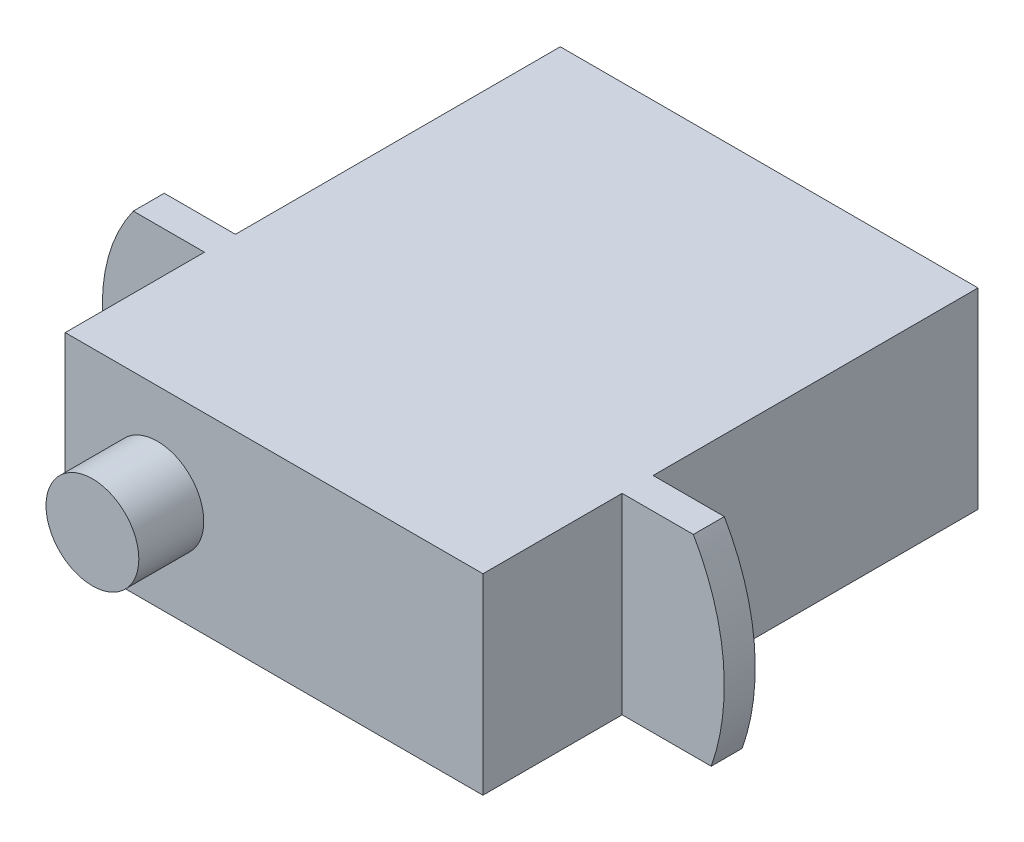
ISO-10303-21;
HEADER;
FILE_DESCRIPTION(('STEP AP214'),'2;1');
FILE_NAME('part.step','',(''),(''),'','','');
FILE_SCHEMA(('AUTOMOTIVE_DESIGN { 1 0 10303 214 1 1 1 1 }'));
ENDSEC;
DATA;
#1=APPLICATION_CONTEXT('core data for automotive mechanical design processes');
#2=APPLICATION_PROTOCOL_DEFINITION('international standard','automotive_design',2000,#1);
#3=PRODUCT_CONTEXT('',#1,'mechanical');
#4=PRODUCT('Part','Part','',(#3));
#5=PRODUCT_RELATED_PRODUCT_CATEGORY('part','',(#4));
#6=PRODUCT_DEFINITION_FORMATION('','',#4);
#7=PRODUCT_DEFINITION_CONTEXT('part definition',#1,'design');
#8=PRODUCT_DEFINITION('design','',#6,#7);
#9=PRODUCT_DEFINITION_SHAPE('','',#8);
#10=(LENGTH_UNIT() NAMED_UNIT(*) SI_UNIT(.MILLI.,.METRE.));
#11=(NAMED_UNIT(*) PLANE_ANGLE_UNIT() SI_UNIT($,.RADIAN.));
#12=(NAMED_UNIT(*) SI_UNIT($,.STERADIAN.) SOLID_ANGLE_UNIT());
#13=UNCERTAINTY_MEASURE_WITH_UNIT(LENGTH_MEASURE(1.E-05),#10,'distance_accuracy_value','');
#14=(GEOMETRIC_REPRESENTATION_CONTEXT(3) GLOBAL_UNCERTAINTY_ASSIGNED_CONTEXT((#13)) GLOBAL_UNIT_ASSIGNED_CONTEXT((#10,
#11,#12)) REPRESENTATION_CONTEXT('',''));
#15=CARTESIAN_POINT('',(0.,0.,0.));
#16=DIRECTION('',(0.,0.,1.));
#17=DIRECTION('',(1.,0.,0.));
#18=AXIS2_PLACEMENT_3D('',#15,#16,#17);
#19=CARTESIAN_POINT('',(0.42209302325582,0.,4.33720930232557));
#20=DIRECTION('',(0.,0.,-1.));
#21=DIRECTION('',(-1.,0.,0.));
#22=AXIS2_PLACEMENT_3D('',#19,#20,#21);
#23=PLANE('',#22);
#24=DIRECTION('',(-1.,0.,0.));
#25=VECTOR('',#24,1.);
#26=CARTESIAN_POINT('',(0.42209302325582,0.,4.33720930232557));
#27=LINE('',#26,#25);
#28=CARTESIAN_POINT('',(0.,0.,4.33720930232557));
#29=VERTEX_POINT('',#28);
#30=CARTESIAN_POINT('',(-2.87790697674418,0.,4.33720930232557));
#31=VERTEX_POINT('',#30);
#32=EDGE_CURVE('E148',#29,#31,#27,.T.);
#33=ORIENTED_EDGE('',*,*,#32,.F.);
#34=CARTESIAN_POINT('',(-7.02718069084928,2.47192443367758,4.33720930232557));
#35=DIRECTION('',(0.,0.,1.));
#36=DIRECTION('',(1.,0.,0.));
#37=AXIS2_PLACEMENT_3D('',#34,#35,#36);
#38=CIRCLE('',#37,7.4492737141051);
#39=CARTESIAN_POINT('',(-0.57790697674418,6.2,4.33720930232557));
#40=VERTEX_POINT('',#39);
#41=EDGE_CURVE('E137',#40,#29,#38,.F.);
#42=ORIENTED_EDGE('',*,*,#41,.F.);
#43=DIRECTION('',(-1.,0.,0.));
#44=VECTOR('',#43,1.);
#45=CARTESIAN_POINT('',(0.42209302325582,6.2,4.33720930232557));
#46=LINE('',#45,#44);
#47=CARTESIAN_POINT('',(-2.87790697674418,6.2,4.33720930232557));
#48=VERTEX_POINT('',#47);
#49=EDGE_CURVE('E69',#40,#48,#46,.T.);
#50=ORIENTED_EDGE('',*,*,#49,.T.);
#51=DIRECTION('',(0.,-1.,0.));
#52=VECTOR('',#51,1.);
#53=CARTESIAN_POINT('',(-2.87790697674418,0.,4.33720930232557));
#54=LINE('',#53,#52);
#55=EDGE_CURVE('E153',#48,#31,#54,.T.);
#56=ORIENTED_EDGE('',*,*,#55,.T.);
#57=EDGE_LOOP('',(#33,#42,#50,#56));
#58=FACE_BOUND('',#57,.T.);
#59=ADVANCED_FACE('F46',(#58),#23,.F.);
#60=CARTESIAN_POINT('',(0.422093023255819,0.,3.33720930232558));
#61=DIRECTION('',(0.,0.,1.));
#62=DIRECTION('',(1.,0.,0.));
#63=AXIS2_PLACEMENT_3D('',#60,#61,#62);
#64=PLANE('',#63);
#65=CARTESIAN_POINT('',(-7.02718069084928,2.47192443367758,3.33720930232558));
#66=DIRECTION('',(0.,0.,1.));
#67=DIRECTION('',(1.,0.,0.));
#68=AXIS2_PLACEMENT_3D('',#65,#66,#67);
#69=CIRCLE('',#68,7.4492737141051);
#70=CARTESIAN_POINT('',(-0.57790697674418,6.2,3.33720930232558));
#71=VERTEX_POINT('',#70);
#72=CARTESIAN_POINT('',(0.,0.,3.33720930232558));
#73=VERTEX_POINT('',#72);
#74=EDGE_CURVE('E261',#71,#73,#69,.F.);
#75=ORIENTED_EDGE('',*,*,#74,.T.);
#76=DIRECTION('',(-1.,0.,0.));
#77=VECTOR('',#76,1.);
#78=CARTESIAN_POINT('',(0.422093023255819,0.,3.33720930232558));
#79=LINE('',#78,#77);
#80=CARTESIAN_POINT('',(-2.87790697674418,0.,3.33720930232558));
#81=VERTEX_POINT('',#80);
#82=EDGE_CURVE('E151',#73,#81,#79,.T.);
#83=ORIENTED_EDGE('',*,*,#82,.T.);
#84=DIRECTION('',(0.,1.,0.));
#85=VECTOR('',#84,1.);
#86=CARTESIAN_POINT('',(-2.87790697674418,0.,3.33720930232558));
#87=LINE('',#86,#85);
#88=CARTESIAN_POINT('',(-2.87790697674418,6.2,3.33720930232558));
#89=VERTEX_POINT('',#88);
#90=EDGE_CURVE('E258',#81,#89,#87,.T.);
#91=ORIENTED_EDGE('',*,*,#90,.T.);
#92=DIRECTION('',(-1.,0.,0.));
#93=VECTOR('',#92,1.);
#94=CARTESIAN_POINT('',(0.422093023255819,6.2,3.33720930232558));
#95=LINE('',#94,#93);
#96=EDGE_CURVE('E61',#71,#89,#95,.T.);
#97=ORIENTED_EDGE('',*,*,#96,.F.);
#98=EDGE_LOOP('',(#75,#83,#91,#97));
#99=FACE_BOUND('',#98,.T.);
#100=ADVANCED_FACE('F265',(#99),#64,.F.);
#101=CARTESIAN_POINT('',(-2.87790697674418,6.2,-7.16279069767442));
#102=DIRECTION('',(-1.,0.,0.));
#103=DIRECTION('',(0.,0.,1.));
#104=AXIS2_PLACEMENT_3D('',#101,#102,#103);
#105=PLANE('',#104);
#106=ORIENTED_EDGE('',*,*,#90,.F.);
#107=DIRECTION('',(0.,0.,-1.));
#108=VECTOR('',#107,1.);
#109=CARTESIAN_POINT('',(-2.87790697674418,0.,-7.16279069767442));
#110=LINE('',#109,#108);
#111=CARTESIAN_POINT('',(-2.87790697674418,0.,-7.16279069767442));
#112=VERTEX_POINT('',#111);
#113=EDGE_CURVE('E205',#81,#112,#110,.T.);
#114=ORIENTED_EDGE('',*,*,#113,.T.);
#115=DIRECTION('',(0.,-1.,0.));
#116=VECTOR('',#115,1.);
#117=CARTESIAN_POINT('',(-2.87790697674418,6.2,-7.16279069767442));
#118=LINE('',#117,#116);
#119=CARTESIAN_POINT('',(-2.87790697674418,6.2,-7.16279069767442));
#120=VERTEX_POINT('',#119);
#121=EDGE_CURVE('E212',#120,#112,#118,.T.);
#122=ORIENTED_EDGE('',*,*,#121,.F.);
#123=DIRECTION('',(0.,0.,-1.));
#124=VECTOR('',#123,1.);
#125=CARTESIAN_POINT('',(-2.87790697674418,6.2,-7.16279069767442));
#126=LINE('',#125,#124);
#127=EDGE_CURVE('E193',#89,#120,#126,.T.);
#128=ORIENTED_EDGE('',*,*,#127,.F.);
#129=EDGE_LOOP('',(#106,#114,#122,#128));
#130=FACE_BOUND('',#129,.T.);
#131=ADVANCED_FACE('F256',(#130),#105,.F.);
#132=ORIENTED_EDGE('',*,*,#55,.F.);
#133=CARTESIAN_POINT('',(-2.87790697674418,6.2,8.83720930232558));
#134=VERTEX_POINT('',#133);
#135=EDGE_CURVE('E194',#134,#48,#126,.T.);
#136=ORIENTED_EDGE('',*,*,#135,.F.);
#137=DIRECTION('',(0.,-1.,0.));
#138=VECTOR('',#137,1.);
#139=CARTESIAN_POINT('',(-2.87790697674418,6.2,8.83720930232558));
#140=LINE('',#139,#138);
#141=CARTESIAN_POINT('',(-2.87790697674418,0.,8.83720930232558));
#142=VERTEX_POINT('',#141);
#143=EDGE_CURVE('E215',#134,#142,#140,.T.);
#144=ORIENTED_EDGE('',*,*,#143,.T.);
#145=EDGE_CURVE('E206',#142,#31,#110,.T.);
#146=ORIENTED_EDGE('',*,*,#145,.T.);
#147=EDGE_LOOP('',(#132,#136,#144,#146));
#148=FACE_BOUND('',#147,.T.);
#149=ADVANCED_FACE('F230',(#148),#105,.F.);
#150=CARTESIAN_POINT('',(-19.6779069767442,6.2,4.33720930232558));
#151=DIRECTION('',(0.,0.,-1.));
#152=DIRECTION('',(-1.,0.,0.));
#153=AXIS2_PLACEMENT_3D('',#150,#151,#152);
#154=PLANE('',#153);
#155=CARTESIAN_POINT('',(-14.3729069767442,3.1,4.33720930232558));
#156=DIRECTION('',(0.,0.,1.));
#157=DIRECTION('',(1.,0.,0.));
#158=AXIS2_PLACEMENT_3D('',#155,#156,#157);
#159=CIRCLE('',#158,5.30499999999999);
#160=CARTESIAN_POINT('',(-18.6779069767442,6.2,4.33720930232558));
#161=VERTEX_POINT('',#160);
#162=CARTESIAN_POINT('',(-18.6779069767442,0.,4.33720930232558));
#163=VERTEX_POINT('',#162);
#164=EDGE_CURVE('E162',#161,#163,#159,.T.);
#165=ORIENTED_EDGE('',*,*,#164,.T.);
#166=DIRECTION('',(1.,0.,0.));
#167=VECTOR('',#166,1.);
#168=CARTESIAN_POINT('',(-19.6779069767442,0.,4.33720930232558));
#169=LINE('',#168,#167);
#170=CARTESIAN_POINT('',(-16.3779069767442,0.,4.33720930232558));
#171=VERTEX_POINT('',#170);
#172=EDGE_CURVE('E175',#163,#171,#169,.T.);
#173=ORIENTED_EDGE('',*,*,#172,.T.);
#174=DIRECTION('',(0.,1.,0.));
#175=VECTOR('',#174,1.);
#176=CARTESIAN_POINT('',(-16.3779069767442,6.2,4.33720930232558));
#177=LINE('',#176,#175);
#178=CARTESIAN_POINT('',(-16.3779069767442,6.2,4.33720930232558));
#179=VERTEX_POINT('',#178);
#180=EDGE_CURVE('E169',#171,#179,#177,.T.);
#181=ORIENTED_EDGE('',*,*,#180,.T.);
#182=DIRECTION('',(1.,0.,0.));
#183=VECTOR('',#182,1.);
#184=CARTESIAN_POINT('',(-19.6779069767442,6.2,4.33720930232558));
#185=LINE('',#184,#183);
#186=EDGE_CURVE('E181',#161,#179,#185,.T.);
#187=ORIENTED_EDGE('',*,*,#186,.F.);
#188=EDGE_LOOP('',(#165,#173,#181,#187));
#189=FACE_BOUND('',#188,.T.);
#190=ADVANCED_FACE('F236',(#189),#154,.F.);
#191=CARTESIAN_POINT('',(-19.6779069767442,6.2,3.33720930232558));
#192=DIRECTION('',(0.,0.,1.));
#193=DIRECTION('',(1.,0.,0.));
#194=AXIS2_PLACEMENT_3D('',#191,#192,#193);
#195=PLANE('',#194);
#196=DIRECTION('',(1.,0.,0.));
#197=VECTOR('',#196,1.);
#198=CARTESIAN_POINT('',(-19.6779069767442,0.,3.33720930232558));
#199=LINE('',#198,#197);
#200=CARTESIAN_POINT('',(-18.6779069767442,0.,3.33720930232558));
#201=VERTEX_POINT('',#200);
#202=CARTESIAN_POINT('',(-16.3779069767442,0.,3.33720930232558));
#203=VERTEX_POINT('',#202);
#204=EDGE_CURVE('E177',#201,#203,#199,.T.);
#205=ORIENTED_EDGE('',*,*,#204,.F.);
#206=CARTESIAN_POINT('',(-14.3729069767442,3.1,3.33720930232558));
#207=DIRECTION('',(0.,0.,1.));
#208=DIRECTION('',(1.,0.,0.));
#209=AXIS2_PLACEMENT_3D('',#206,#207,#208);
#210=CIRCLE('',#209,5.30499999999999);
#211=CARTESIAN_POINT('',(-18.6779069767442,6.2,3.33720930232558));
#212=VERTEX_POINT('',#211);
#213=EDGE_CURVE('E167',#212,#201,#210,.T.);
#214=ORIENTED_EDGE('',*,*,#213,.F.);
#215=DIRECTION('',(1.,0.,0.));
#216=VECTOR('',#215,1.);
#217=CARTESIAN_POINT('',(-19.6779069767442,6.2,3.33720930232558));
#218=LINE('',#217,#216);
#219=CARTESIAN_POINT('',(-16.3779069767442,6.2,3.33720930232558));
#220=VERTEX_POINT('',#219);
#221=EDGE_CURVE('E179',#212,#220,#218,.T.);
#222=ORIENTED_EDGE('',*,*,#221,.T.);
#223=DIRECTION('',(0.,-1.,0.));
#224=VECTOR('',#223,1.);
#225=CARTESIAN_POINT('',(-16.3779069767442,6.2,3.33720930232558));
#226=LINE('',#225,#224);
#227=EDGE_CURVE('E172',#220,#203,#226,.T.);
#228=ORIENTED_EDGE('',*,*,#227,.T.);
#229=EDGE_LOOP('',(#205,#214,#222,#228));
#230=FACE_BOUND('',#229,.T.);
#231=ADVANCED_FACE('F243',(#230),#195,.F.);
#232=CARTESIAN_POINT('',(0.,0.,0.));
#233=DIRECTION('',(0.,1.,0.));
#234=DIRECTION('',(0.,0.,1.));
#235=AXIS2_PLACEMENT_3D('',#232,#233,#234);
#236=PLANE('',#235);
#237=ORIENTED_EDGE('',*,*,#82,.F.);
#238=DIRECTION('',(0.,0.,1.));
#239=VECTOR('',#238,1.);
#240=CARTESIAN_POINT('',(0.,0.,0.337209302325574));
#241=LINE('',#240,#239);
#242=EDGE_CURVE('E140',#73,#29,#241,.T.);
#243=ORIENTED_EDGE('',*,*,#242,.T.);
#244=ORIENTED_EDGE('',*,*,#32,.T.);
#245=ORIENTED_EDGE('',*,*,#145,.F.);
#246=DIRECTION('',(1.,0.,0.));
#247=VECTOR('',#246,1.);
#248=CARTESIAN_POINT('',(-16.3779069767442,0.,8.83720930232558));
#249=LINE('',#248,#247);
#250=CARTESIAN_POINT('',(-16.3779069767442,0.,8.83720930232558));
#251=VERTEX_POINT('',#250);
#252=EDGE_CURVE('E203',#251,#142,#249,.T.);
#253=ORIENTED_EDGE('',*,*,#252,.F.);
#254=DIRECTION('',(0.,0.,1.));
#255=VECTOR('',#254,1.);
#256=CARTESIAN_POINT('',(-16.3779069767442,0.,-7.16279069767442));
#257=LINE('',#256,#255);
#258=EDGE_CURVE('E186',#171,#251,#257,.T.);
#259=ORIENTED_EDGE('',*,*,#258,.F.);
#260=ORIENTED_EDGE('',*,*,#172,.F.);
#261=DIRECTION('',(0.,0.,1.));
#262=VECTOR('',#261,1.);
#263=CARTESIAN_POINT('',(-18.6779069767442,0.,0.337209302325578));
#264=LINE('',#263,#262);
#265=EDGE_CURVE('E155',#201,#163,#264,.T.);
#266=ORIENTED_EDGE('',*,*,#265,.F.);
#267=ORIENTED_EDGE('',*,*,#204,.T.);
#268=CARTESIAN_POINT('',(-16.3779069767442,0.,-7.16279069767442));
#269=VERTEX_POINT('',#268);
#270=EDGE_CURVE('E200',#269,#203,#257,.T.);
#271=ORIENTED_EDGE('',*,*,#270,.F.);
#272=DIRECTION('',(-1.,0.,0.));
#273=VECTOR('',#272,1.);
#274=CARTESIAN_POINT('',(-16.3779069767442,0.,-7.16279069767442));
#275=LINE('',#274,#273);
#276=EDGE_CURVE('E208',#112,#269,#275,.T.);
#277=ORIENTED_EDGE('',*,*,#276,.F.);
#278=ORIENTED_EDGE('',*,*,#113,.F.);
#279=EDGE_LOOP('',(#237,#243,#244,#245,#253,#259,#260,#266,#267,#271,#277,#278));
#280=FACE_BOUND('',#279,.T.);
#281=ADVANCED_FACE('F146',(#280),#236,.F.);
#282=CARTESIAN_POINT('',(0.,6.2,0.));
#283=DIRECTION('',(0.,1.,0.));
#284=DIRECTION('',(0.,0.,1.));
#285=AXIS2_PLACEMENT_3D('',#282,#283,#284);
#286=PLANE('',#285);
#287=DIRECTION('',(0.,0.,1.));
#288=VECTOR('',#287,1.);
#289=CARTESIAN_POINT('',(-0.57790697674418,6.2,0.337209302325574));
#290=LINE('',#289,#288);
#291=EDGE_CURVE('E142',#71,#40,#290,.T.);
#292=ORIENTED_EDGE('',*,*,#291,.F.);
#293=ORIENTED_EDGE('',*,*,#96,.T.);
#294=ORIENTED_EDGE('',*,*,#127,.T.);
#295=DIRECTION('',(-1.,0.,0.));
#296=VECTOR('',#295,1.);
#297=CARTESIAN_POINT('',(-16.3779069767442,6.2,-7.16279069767442));
#298=LINE('',#297,#296);
#299=CARTESIAN_POINT('',(-16.3779069767442,6.2,-7.16279069767442));
#300=VERTEX_POINT('',#299);
#301=EDGE_CURVE('E197',#120,#300,#298,.T.);
#302=ORIENTED_EDGE('',*,*,#301,.T.);
#303=DIRECTION('',(0.,0.,1.));
#304=VECTOR('',#303,1.);
#305=CARTESIAN_POINT('',(-16.3779069767442,6.2,-7.16279069767442));
#306=LINE('',#305,#304);
#307=EDGE_CURVE('E187',#300,#220,#306,.T.);
#308=ORIENTED_EDGE('',*,*,#307,.T.);
#309=ORIENTED_EDGE('',*,*,#221,.F.);
#310=DIRECTION('',(0.,0.,1.));
#311=VECTOR('',#310,1.);
#312=CARTESIAN_POINT('',(-18.6779069767442,6.2,0.337209302325578));
#313=LINE('',#312,#311);
#314=EDGE_CURVE('E164',#212,#161,#313,.T.);
#315=ORIENTED_EDGE('',*,*,#314,.T.);
#316=ORIENTED_EDGE('',*,*,#186,.T.);
#317=CARTESIAN_POINT('',(-16.3779069767442,6.2,8.83720930232558));
#318=VERTEX_POINT('',#317);
#319=EDGE_CURVE('E191',#179,#318,#306,.T.);
#320=ORIENTED_EDGE('',*,*,#319,.T.);
#321=DIRECTION('',(1.,0.,0.));
#322=VECTOR('',#321,1.);
#323=CARTESIAN_POINT('',(-16.3779069767442,6.2,8.83720930232558));
#324=LINE('',#323,#322);
#325=EDGE_CURVE('E190',#318,#134,#324,.T.);
#326=ORIENTED_EDGE('',*,*,#325,.T.);
#327=ORIENTED_EDGE('',*,*,#135,.T.);
#328=ORIENTED_EDGE('',*,*,#49,.F.);
#329=EDGE_LOOP('',(#292,#293,#294,#302,#308,#309,#315,#316,#320,#326,#327,#328));
#330=FACE_BOUND('',#329,.T.);
#331=ADVANCED_FACE('F232',(#330),#286,.T.);
#332=CARTESIAN_POINT('',(-16.3779069767442,6.2,-7.16279069767442));
#333=DIRECTION('',(1.,0.,0.));
#334=DIRECTION('',(0.,0.,-1.));
#335=AXIS2_PLACEMENT_3D('',#332,#333,#334);
#336=PLANE('',#335);
#337=ORIENTED_EDGE('',*,*,#180,.F.);
#338=ORIENTED_EDGE('',*,*,#258,.T.);
#339=DIRECTION('',(0.,-1.,0.));
#340=VECTOR('',#339,1.);
#341=CARTESIAN_POINT('',(-16.3779069767442,6.2,8.83720930232558));
#342=LINE('',#341,#340);
#343=EDGE_CURVE('E54',#318,#251,#342,.T.);
#344=ORIENTED_EDGE('',*,*,#343,.F.);
#345=ORIENTED_EDGE('',*,*,#319,.F.);
#346=EDGE_LOOP('',(#337,#338,#344,#345));
#347=FACE_BOUND('',#346,.T.);
#348=ADVANCED_FACE('F48',(#347),#336,.F.);
#349=ORIENTED_EDGE('',*,*,#227,.F.);
#350=ORIENTED_EDGE('',*,*,#307,.F.);
#351=DIRECTION('',(0.,-1.,0.));
#352=VECTOR('',#351,1.);
#353=CARTESIAN_POINT('',(-16.3779069767442,6.2,-7.16279069767442));
#354=LINE('',#353,#352);
#355=EDGE_CURVE('E199',#300,#269,#354,.T.);
#356=ORIENTED_EDGE('',*,*,#355,.T.);
#357=ORIENTED_EDGE('',*,*,#270,.T.);
#358=EDGE_LOOP('',(#349,#350,#356,#357));
#359=FACE_BOUND('',#358,.T.);
#360=ADVANCED_FACE('F247',(#359),#336,.F.);
#361=CARTESIAN_POINT('',(-16.3779069767442,6.2,8.83720930232558));
#362=DIRECTION('',(0.,0.,-1.));
#363=DIRECTION('',(-1.,0.,0.));
#364=AXIS2_PLACEMENT_3D('',#361,#362,#363);
#365=PLANE('',#364);
#366=CARTESIAN_POINT('',(-13.3993619555422,3.14842096263798,8.83720930232558));
#367=DIRECTION('',(0.,0.,-1.));
#368=DIRECTION('',(-1.,0.,0.));
#369=AXIS2_PLACEMENT_3D('',#366,#367,#368);
#370=CIRCLE('',#369,1.5);
#371=CARTESIAN_POINT('',(-14.8993619555422,3.14842096263798,8.83720930232558));
#372=VERTEX_POINT('',#371);
#373=EDGE_CURVE('E12',#372,#372,#370,.F.);
#374=ORIENTED_EDGE('',*,*,#373,.F.);
#375=EDGE_LOOP('',(#374));
#376=FACE_BOUND('',#375,.T.);
#377=ORIENTED_EDGE('',*,*,#252,.T.);
#378=ORIENTED_EDGE('',*,*,#143,.F.);
#379=ORIENTED_EDGE('',*,*,#325,.F.);
#380=ORIENTED_EDGE('',*,*,#343,.T.);
#381=EDGE_LOOP('',(#377,#378,#379,#380));
#382=FACE_BOUND('',#381,.T.);
#383=ADVANCED_FACE('F221',(#376,#382),#365,.F.);
#384=CARTESIAN_POINT('',(-16.3779069767442,6.2,-7.16279069767442));
#385=DIRECTION('',(0.,0.,1.));
#386=DIRECTION('',(1.,0.,0.));
#387=AXIS2_PLACEMENT_3D('',#384,#385,#386);
#388=PLANE('',#387);
#389=ORIENTED_EDGE('',*,*,#276,.T.);
#390=ORIENTED_EDGE('',*,*,#355,.F.);
#391=ORIENTED_EDGE('',*,*,#301,.F.);
#392=ORIENTED_EDGE('',*,*,#121,.T.);
#393=EDGE_LOOP('',(#389,#390,#391,#392));
#394=FACE_BOUND('',#393,.T.);
#395=ADVANCED_FACE('F252',(#394),#388,.F.);
#396=CARTESIAN_POINT('',(-13.3993619555422,3.14842096263798,10.9372093023256));
#397=DIRECTION('',(0.,0.,-1.));
#398=DIRECTION('',(-1.,0.,0.));
#399=AXIS2_PLACEMENT_3D('',#396,#397,#398);
#400=CYLINDRICAL_SURFACE('',#399,1.5);
#401=CARTESIAN_POINT('',(-13.3993619555422,3.14842096263798,10.9372093023256));
#402=DIRECTION('',(0.,0.,1.));
#403=DIRECTION('',(1.,0.,0.));
#404=AXIS2_PLACEMENT_3D('',#401,#402,#403);
#405=CIRCLE('',#404,1.5);
#406=CARTESIAN_POINT('',(-11.8993619555422,3.14842096263798,10.9372093023256));
#407=VERTEX_POINT('',#406);
#408=EDGE_CURVE('E183',#407,#407,#405,.T.);
#409=ORIENTED_EDGE('',*,*,#408,.F.);
#410=EDGE_LOOP('',(#409));
#411=FACE_BOUND('',#410,.T.);
#412=ORIENTED_EDGE('',*,*,#373,.T.);
#413=EDGE_LOOP('',(#412));
#414=FACE_BOUND('',#413,.T.);
#415=ADVANCED_FACE('F286',(#411,#414),#400,.T.);
#416=CARTESIAN_POINT('',(-13.3993619555422,3.14842096263798,10.9372093023256));
#417=DIRECTION('',(0.,0.,1.));
#418=DIRECTION('',(1.,0.,0.));
#419=AXIS2_PLACEMENT_3D('',#416,#417,#418);
#420=PLANE('',#419);
#421=ORIENTED_EDGE('',*,*,#408,.T.);
#422=EDGE_LOOP('',(#421));
#423=FACE_BOUND('',#422,.T.);
#424=ADVANCED_FACE('F279',(#423),#420,.T.);
#425=CARTESIAN_POINT('',(-14.3729069767442,3.1,0.337209302325578));
#426=DIRECTION('',(0.,0.,1.));
#427=DIRECTION('',(1.,0.,0.));
#428=AXIS2_PLACEMENT_3D('',#425,#426,#427);
#429=CYLINDRICAL_SURFACE('',#428,5.30499999999999);
#430=ORIENTED_EDGE('',*,*,#213,.T.);
#431=ORIENTED_EDGE('',*,*,#265,.T.);
#432=ORIENTED_EDGE('',*,*,#164,.F.);
#433=ORIENTED_EDGE('',*,*,#314,.F.);
#434=EDGE_LOOP('',(#430,#431,#432,#433));
#435=FACE_BOUND('',#434,.T.);
#436=ADVANCED_FACE('F276',(#435),#429,.T.);
#437=CARTESIAN_POINT('',(-7.02718069084928,2.47192443367758,0.337209302325574));
#438=DIRECTION('',(0.,0.,1.));
#439=DIRECTION('',(1.,0.,0.));
#440=AXIS2_PLACEMENT_3D('',#437,#438,#439);
#441=CYLINDRICAL_SURFACE('',#440,7.4492737141051);
#442=ORIENTED_EDGE('',*,*,#291,.T.);
#443=ORIENTED_EDGE('',*,*,#41,.T.);
#444=ORIENTED_EDGE('',*,*,#242,.F.);
#445=ORIENTED_EDGE('',*,*,#74,.F.);
#446=EDGE_LOOP('',(#442,#443,#444,#445));
#447=FACE_BOUND('',#446,.T.);
#448=ADVANCED_FACE('F139',(#447),#441,.T.);
#449=CLOSED_SHELL('',(#59,#100,#131,#149,#190,#231,#281,#331,#348,#360,#383,#395,#415,#424,#436,#448));
#450=MANIFOLD_SOLID_BREP('B2',#449);
#451=ADVANCED_BREP_SHAPE_REPRESENTATION('',(#18,#450),#14);
#452=SHAPE_DEFINITION_REPRESENTATION(#9,#451);
ENDSEC;
END-ISO-10303-21;
